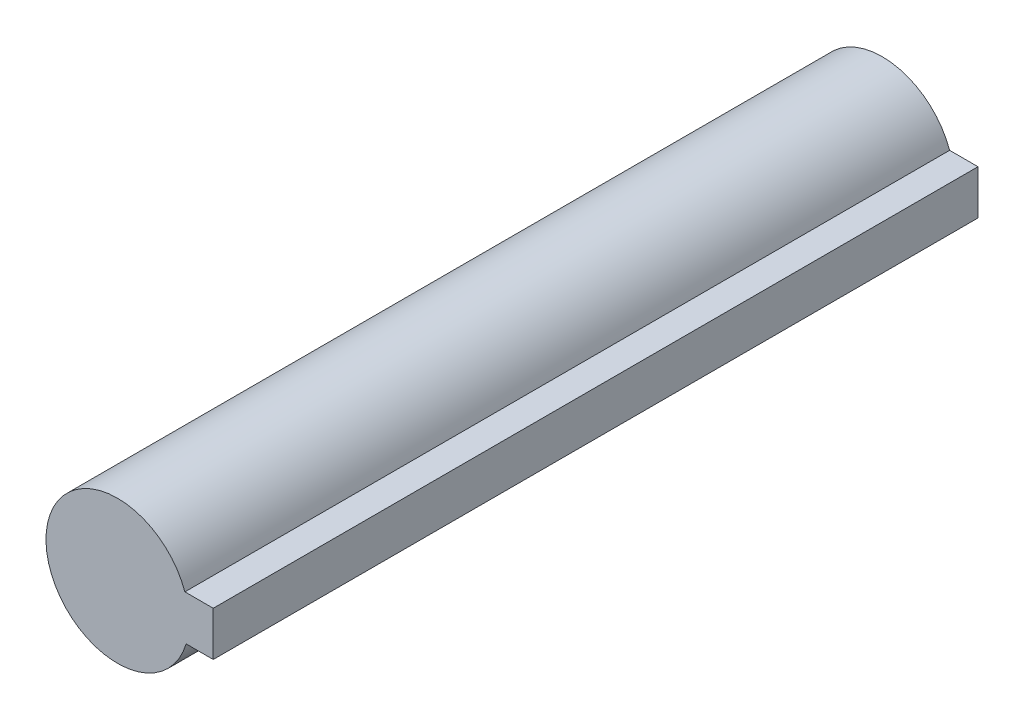
ISO-10303-21;
HEADER;
FILE_DESCRIPTION(('STEP AP214'),'2;1');
FILE_NAME('part.step','',(''),(''),'','','');
FILE_SCHEMA(('AUTOMOTIVE_DESIGN { 1 0 10303 214 1 1 1 1 }'));
ENDSEC;
DATA;
#1=APPLICATION_CONTEXT('core data for automotive mechanical design processes');
#2=APPLICATION_PROTOCOL_DEFINITION('international standard','automotive_design',2000,#1);
#3=PRODUCT_CONTEXT('',#1,'mechanical');
#4=PRODUCT('Part','Part','',(#3));
#5=PRODUCT_RELATED_PRODUCT_CATEGORY('part','',(#4));
#6=PRODUCT_DEFINITION_FORMATION('','',#4);
#7=PRODUCT_DEFINITION_CONTEXT('part definition',#1,'design');
#8=PRODUCT_DEFINITION('design','',#6,#7);
#9=PRODUCT_DEFINITION_SHAPE('','',#8);
#10=(LENGTH_UNIT() NAMED_UNIT(*) SI_UNIT(.MILLI.,.METRE.));
#11=(NAMED_UNIT(*) PLANE_ANGLE_UNIT() SI_UNIT($,.RADIAN.));
#12=(NAMED_UNIT(*) SI_UNIT($,.STERADIAN.) SOLID_ANGLE_UNIT());
#13=UNCERTAINTY_MEASURE_WITH_UNIT(LENGTH_MEASURE(1.E-05),#10,'distance_accuracy_value','');
#14=(GEOMETRIC_REPRESENTATION_CONTEXT(3) GLOBAL_UNCERTAINTY_ASSIGNED_CONTEXT((#13)) GLOBAL_UNIT_ASSIGNED_CONTEXT((#10,
#11,#12)) REPRESENTATION_CONTEXT('',''));
#15=CARTESIAN_POINT('',(0.,0.,0.));
#16=DIRECTION('',(0.,0.,1.));
#17=DIRECTION('',(1.,0.,0.));
#18=AXIS2_PLACEMENT_3D('',#15,#16,#17);
#19=CARTESIAN_POINT('',(2.73063346722772,0.976545374089658,31.));
#20=DIRECTION('',(0.,-1.,0.));
#21=DIRECTION('',(1.,0.,0.));
#22=AXIS2_PLACEMENT_3D('',#19,#20,#21);
#23=PLANE('',#22);
#24=DIRECTION('',(-1.,0.,0.));
#25=VECTOR('',#24,1.);
#26=CARTESIAN_POINT('',(2.73063346722772,0.976545374089658,0.));
#27=LINE('',#26,#25);
#28=CARTESIAN_POINT('',(3.88063346722772,0.976545374089659,0.));
#29=VERTEX_POINT('',#28);
#30=CARTESIAN_POINT('',(2.73063346722772,0.976545374089658,0.));
#31=VERTEX_POINT('',#30);
#32=EDGE_CURVE('E113',#29,#31,#27,.T.);
#33=ORIENTED_EDGE('',*,*,#32,.T.);
#34=DIRECTION('',(0.,0.,-1.));
#35=VECTOR('',#34,1.);
#36=CARTESIAN_POINT('',(2.73063346722772,0.976545374089658,31.));
#37=LINE('',#36,#35);
#38=CARTESIAN_POINT('',(2.73063346722772,0.976545374089658,31.));
#39=VERTEX_POINT('',#38);
#40=EDGE_CURVE('E11',#39,#31,#37,.T.);
#41=ORIENTED_EDGE('',*,*,#40,.F.);
#42=DIRECTION('',(-1.,0.,0.));
#43=VECTOR('',#42,1.);
#44=CARTESIAN_POINT('',(2.73063346722772,0.976545374089658,31.));
#45=LINE('',#44,#43);
#46=CARTESIAN_POINT('',(3.88063346722772,0.976545374089659,31.));
#47=VERTEX_POINT('',#46);
#48=EDGE_CURVE('E97',#47,#39,#45,.T.);
#49=ORIENTED_EDGE('',*,*,#48,.F.);
#50=DIRECTION('',(0.,0.,-1.));
#51=VECTOR('',#50,1.);
#52=CARTESIAN_POINT('',(3.88063346722772,0.976545374089659,31.));
#53=LINE('',#52,#51);
#54=EDGE_CURVE('E109',#47,#29,#53,.T.);
#55=ORIENTED_EDGE('',*,*,#54,.T.);
#56=EDGE_LOOP('',(#33,#41,#49,#55));
#57=FACE_BOUND('',#56,.T.);
#58=ADVANCED_FACE('F45',(#57),#23,.F.);
#59=CARTESIAN_POINT('',(0.,0.,31.));
#60=DIRECTION('',(0.,0.,-1.));
#61=DIRECTION('',(-1.,0.,0.));
#62=AXIS2_PLACEMENT_3D('',#59,#60,#61);
#63=CYLINDRICAL_SURFACE('',#62,2.9);
#64=CARTESIAN_POINT('',(0.,0.,0.));
#65=DIRECTION('',(0.,0.,1.));
#66=DIRECTION('',(1.,0.,0.));
#67=AXIS2_PLACEMENT_3D('',#64,#65,#66);
#68=CIRCLE('',#67,2.9);
#69=CARTESIAN_POINT('',(2.78063346722772,-0.823454625910341,0.));
#70=VERTEX_POINT('',#69);
#71=EDGE_CURVE('E102',#31,#70,#68,.T.);
#72=ORIENTED_EDGE('',*,*,#71,.T.);
#73=DIRECTION('',(0.,0.,-1.));
#74=VECTOR('',#73,1.);
#75=CARTESIAN_POINT('',(2.78063346722772,-0.823454625910341,31.));
#76=LINE('',#75,#74);
#77=CARTESIAN_POINT('',(2.78063346722772,-0.823454625910341,31.));
#78=VERTEX_POINT('',#77);
#79=EDGE_CURVE('E54',#78,#70,#76,.T.);
#80=ORIENTED_EDGE('',*,*,#79,.F.);
#81=CARTESIAN_POINT('',(0.,0.,31.));
#82=DIRECTION('',(0.,0.,1.));
#83=DIRECTION('',(1.,0.,0.));
#84=AXIS2_PLACEMENT_3D('',#81,#82,#83);
#85=CIRCLE('',#84,2.9);
#86=EDGE_CURVE('E92',#39,#78,#85,.T.);
#87=ORIENTED_EDGE('',*,*,#86,.F.);
#88=ORIENTED_EDGE('',*,*,#40,.T.);
#89=EDGE_LOOP('',(#72,#80,#87,#88));
#90=FACE_BOUND('',#89,.T.);
#91=ADVANCED_FACE('F101',(#90),#63,.T.);
#92=CARTESIAN_POINT('',(2.78063346722772,-0.823454625910341,31.));
#93=DIRECTION('',(0.,1.,0.));
#94=DIRECTION('',(-1.,0.,0.));
#95=AXIS2_PLACEMENT_3D('',#92,#93,#94);
#96=PLANE('',#95);
#97=DIRECTION('',(1.,0.,0.));
#98=VECTOR('',#97,1.);
#99=CARTESIAN_POINT('',(2.78063346722772,-0.823454625910341,0.));
#100=LINE('',#99,#98);
#101=CARTESIAN_POINT('',(3.88063346722772,-0.823454625910341,0.));
#102=VERTEX_POINT('',#101);
#103=EDGE_CURVE('E79',#70,#102,#100,.T.);
#104=ORIENTED_EDGE('',*,*,#103,.T.);
#105=DIRECTION('',(0.,0.,-1.));
#106=VECTOR('',#105,1.);
#107=CARTESIAN_POINT('',(3.88063346722772,-0.823454625910341,31.));
#108=LINE('',#107,#106);
#109=CARTESIAN_POINT('',(3.88063346722772,-0.823454625910341,31.));
#110=VERTEX_POINT('',#109);
#111=EDGE_CURVE('E104',#110,#102,#108,.T.);
#112=ORIENTED_EDGE('',*,*,#111,.F.);
#113=DIRECTION('',(1.,0.,0.));
#114=VECTOR('',#113,1.);
#115=CARTESIAN_POINT('',(2.78063346722772,-0.823454625910341,31.));
#116=LINE('',#115,#114);
#117=EDGE_CURVE('E95',#78,#110,#116,.T.);
#118=ORIENTED_EDGE('',*,*,#117,.F.);
#119=ORIENTED_EDGE('',*,*,#79,.T.);
#120=EDGE_LOOP('',(#104,#112,#118,#119));
#121=FACE_BOUND('',#120,.T.);
#122=ADVANCED_FACE('F105',(#121),#96,.F.);
#123=CARTESIAN_POINT('',(3.88063346722772,-0.823454625910341,31.));
#124=DIRECTION('',(-1.,0.,0.));
#125=DIRECTION('',(0.,0.,1.));
#126=AXIS2_PLACEMENT_3D('',#123,#124,#125);
#127=PLANE('',#126);
#128=DIRECTION('',(0.,1.,0.));
#129=VECTOR('',#128,1.);
#130=CARTESIAN_POINT('',(3.88063346722772,-0.823454625910341,0.));
#131=LINE('',#130,#129);
#132=EDGE_CURVE('E85',#102,#29,#131,.T.);
#133=ORIENTED_EDGE('',*,*,#132,.T.);
#134=ORIENTED_EDGE('',*,*,#54,.F.);
#135=DIRECTION('',(0.,1.,0.));
#136=VECTOR('',#135,1.);
#137=CARTESIAN_POINT('',(3.88063346722772,-0.823454625910341,31.));
#138=LINE('',#137,#136);
#139=EDGE_CURVE('E62',#110,#47,#138,.T.);
#140=ORIENTED_EDGE('',*,*,#139,.F.);
#141=ORIENTED_EDGE('',*,*,#111,.T.);
#142=EDGE_LOOP('',(#133,#134,#140,#141));
#143=FACE_BOUND('',#142,.T.);
#144=ADVANCED_FACE('F126',(#143),#127,.F.);
#145=CARTESIAN_POINT('',(0.,0.,31.));
#146=DIRECTION('',(0.,0.,1.));
#147=DIRECTION('',(1.,0.,0.));
#148=AXIS2_PLACEMENT_3D('',#145,#146,#147);
#149=PLANE('',#148);
#150=ORIENTED_EDGE('',*,*,#48,.T.);
#151=ORIENTED_EDGE('',*,*,#86,.T.);
#152=ORIENTED_EDGE('',*,*,#117,.T.);
#153=ORIENTED_EDGE('',*,*,#139,.T.);
#154=EDGE_LOOP('',(#150,#151,#152,#153));
#155=FACE_BOUND('',#154,.T.);
#156=ADVANCED_FACE('F93',(#155),#149,.T.);
#157=CARTESIAN_POINT('',(0.,0.,0.));
#158=DIRECTION('',(0.,0.,1.));
#159=DIRECTION('',(1.,0.,0.));
#160=AXIS2_PLACEMENT_3D('',#157,#158,#159);
#161=PLANE('',#160);
#162=ORIENTED_EDGE('',*,*,#32,.F.);
#163=ORIENTED_EDGE('',*,*,#132,.F.);
#164=ORIENTED_EDGE('',*,*,#103,.F.);
#165=ORIENTED_EDGE('',*,*,#71,.F.);
#166=EDGE_LOOP('',(#162,#163,#164,#165));
#167=FACE_BOUND('',#166,.T.);
#168=ADVANCED_FACE('F129',(#167),#161,.F.);
#169=CLOSED_SHELL('',(#58,#91,#122,#144,#156,#168));
#170=MANIFOLD_SOLID_BREP('B2',#169);
#171=ADVANCED_BREP_SHAPE_REPRESENTATION('',(#18,#170),#14);
#172=SHAPE_DEFINITION_REPRESENTATION(#9,#171);
ENDSEC;
END-ISO-10303-21;
